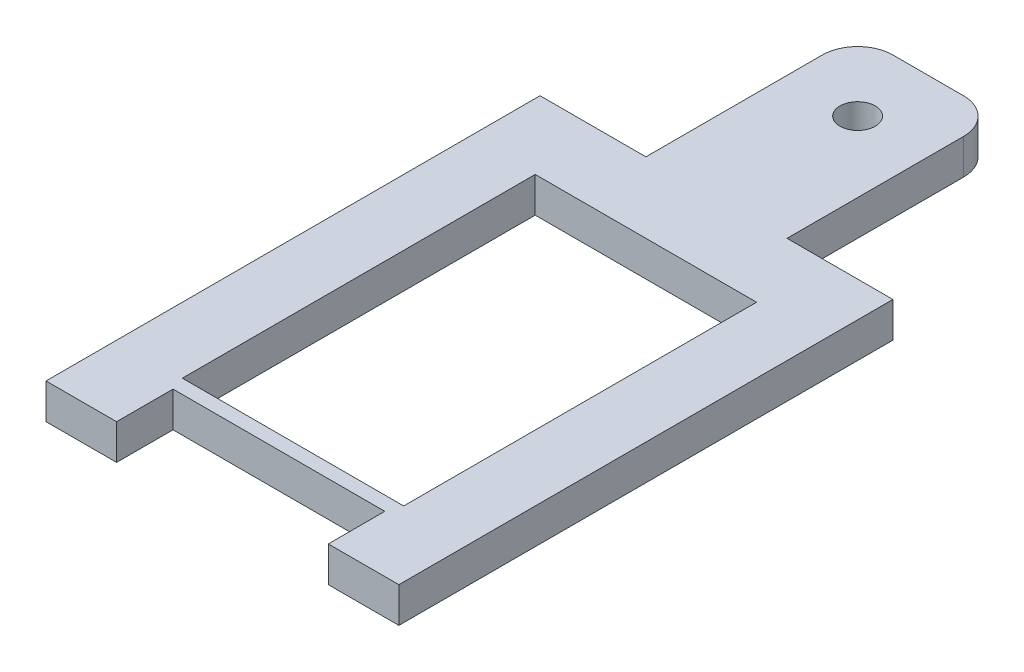
ISO-10303-21;
HEADER;
FILE_DESCRIPTION(('STEP AP214'),'2;1');
FILE_NAME('part.step','',(''),(''),'','','');
FILE_SCHEMA(('AUTOMOTIVE_DESIGN { 1 0 10303 214 1 1 1 1 }'));
ENDSEC;
DATA;
#1=APPLICATION_CONTEXT('core data for automotive mechanical design processes');
#2=APPLICATION_PROTOCOL_DEFINITION('international standard','automotive_design',2000,#1);
#3=PRODUCT_CONTEXT('',#1,'mechanical');
#4=PRODUCT('Part','Part','',(#3));
#5=PRODUCT_RELATED_PRODUCT_CATEGORY('part','',(#4));
#6=PRODUCT_DEFINITION_FORMATION('','',#4);
#7=PRODUCT_DEFINITION_CONTEXT('part definition',#1,'design');
#8=PRODUCT_DEFINITION('design','',#6,#7);
#9=PRODUCT_DEFINITION_SHAPE('','',#8);
#10=(LENGTH_UNIT() NAMED_UNIT(*) SI_UNIT(.MILLI.,.METRE.));
#11=(NAMED_UNIT(*) PLANE_ANGLE_UNIT() SI_UNIT($,.RADIAN.));
#12=(NAMED_UNIT(*) SI_UNIT($,.STERADIAN.) SOLID_ANGLE_UNIT());
#13=UNCERTAINTY_MEASURE_WITH_UNIT(LENGTH_MEASURE(1.E-05),#10,'distance_accuracy_value','');
#14=(GEOMETRIC_REPRESENTATION_CONTEXT(3) GLOBAL_UNCERTAINTY_ASSIGNED_CONTEXT((#13)) GLOBAL_UNIT_ASSIGNED_CONTEXT((#10,
#11,#12)) REPRESENTATION_CONTEXT('',''));
#15=CARTESIAN_POINT('',(0.,0.,0.));
#16=DIRECTION('',(0.,0.,1.));
#17=DIRECTION('',(1.,0.,0.));
#18=AXIS2_PLACEMENT_3D('',#15,#16,#17);
#19=CARTESIAN_POINT('',(1.27,1.27,-15.24));
#20=DIRECTION('',(0.,1.,0.));
#21=DIRECTION('',(0.,0.,1.));
#22=AXIS2_PLACEMENT_3D('',#19,#20,#21);
#23=PLANE('',#22);
#24=DIRECTION('',(1.,0.,0.));
#25=VECTOR('',#24,1.);
#26=CARTESIAN_POINT('',(3.98296055983701,1.27,6.35));
#27=LINE('',#26,#25);
#28=CARTESIAN_POINT('',(-3.98296055983701,1.27,6.35));
#29=VERTEX_POINT('',#28);
#30=CARTESIAN_POINT('',(3.98296055983701,1.27,6.35));
#31=VERTEX_POINT('',#30);
#32=EDGE_CURVE('E167',#29,#31,#27,.T.);
#33=ORIENTED_EDGE('',*,*,#32,.F.);
#34=DIRECTION('',(0.,0.,1.));
#35=VECTOR('',#34,1.);
#36=CARTESIAN_POINT('',(-3.98296055983701,1.27,6.35));
#37=LINE('',#36,#35);
#38=CARTESIAN_POINT('',(-3.98296055983701,1.27,-6.35));
#39=VERTEX_POINT('',#38);
#40=EDGE_CURVE('E159',#39,#29,#37,.T.);
#41=ORIENTED_EDGE('',*,*,#40,.F.);
#42=DIRECTION('',(-1.,0.,0.));
#43=VECTOR('',#42,1.);
#44=CARTESIAN_POINT('',(3.98296055983701,1.27,-6.35));
#45=LINE('',#44,#43);
#46=CARTESIAN_POINT('',(3.98296055983701,1.27,-6.35));
#47=VERTEX_POINT('',#46);
#48=EDGE_CURVE('E182',#47,#39,#45,.T.);
#49=ORIENTED_EDGE('',*,*,#48,.F.);
#50=DIRECTION('',(0.,0.,-1.));
#51=VECTOR('',#50,1.);
#52=CARTESIAN_POINT('',(3.98296055983701,1.27,6.35));
#53=LINE('',#52,#51);
#54=EDGE_CURVE('E180',#31,#47,#53,.T.);
#55=ORIENTED_EDGE('',*,*,#54,.F.);
#56=EDGE_LOOP('',(#33,#41,#49,#55));
#57=FACE_BOUND('',#56,.T.);
#58=DIRECTION('',(-1.,0.,0.));
#59=VECTOR('',#58,1.);
#60=CARTESIAN_POINT('',(-2.54,1.27,-8.89));
#61=LINE('',#60,#59);
#62=CARTESIAN_POINT('',(-2.54,1.27,-8.89));
#63=VERTEX_POINT('',#62);
#64=CARTESIAN_POINT('',(-6.35,1.27,-8.89));
#65=VERTEX_POINT('',#64);
#66=EDGE_CURVE('E198',#63,#65,#61,.T.);
#67=ORIENTED_EDGE('',*,*,#66,.T.);
#68=DIRECTION('',(0.,0.,1.));
#69=VECTOR('',#68,1.);
#70=CARTESIAN_POINT('',(-6.35,1.27,8.89));
#71=LINE('',#70,#69);
#72=CARTESIAN_POINT('',(-6.35,1.27,8.89));
#73=VERTEX_POINT('',#72);
#74=EDGE_CURVE('E201',#65,#73,#71,.T.);
#75=ORIENTED_EDGE('',*,*,#74,.T.);
#76=DIRECTION('',(1.,0.,0.));
#77=VECTOR('',#76,1.);
#78=CARTESIAN_POINT('',(-3.81,1.27,8.89));
#79=LINE('',#78,#77);
#80=CARTESIAN_POINT('',(-3.81,1.27,8.89));
#81=VERTEX_POINT('',#80);
#82=EDGE_CURVE('E204',#73,#81,#79,.T.);
#83=ORIENTED_EDGE('',*,*,#82,.T.);
#84=DIRECTION('',(0.,0.,-1.));
#85=VECTOR('',#84,1.);
#86=CARTESIAN_POINT('',(-3.81,1.27,6.858));
#87=LINE('',#86,#85);
#88=CARTESIAN_POINT('',(-3.81,1.27,6.858));
#89=VERTEX_POINT('',#88);
#90=EDGE_CURVE('E206',#81,#89,#87,.T.);
#91=ORIENTED_EDGE('',*,*,#90,.T.);
#92=DIRECTION('',(1.,0.,0.));
#93=VECTOR('',#92,1.);
#94=CARTESIAN_POINT('',(-3.81,1.27,6.858));
#95=LINE('',#94,#93);
#96=CARTESIAN_POINT('',(3.81,1.27,6.858));
#97=VERTEX_POINT('',#96);
#98=EDGE_CURVE('E208',#89,#97,#95,.T.);
#99=ORIENTED_EDGE('',*,*,#98,.T.);
#100=DIRECTION('',(0.,0.,1.));
#101=VECTOR('',#100,1.);
#102=CARTESIAN_POINT('',(3.81,1.27,6.858));
#103=LINE('',#102,#101);
#104=CARTESIAN_POINT('',(3.81,1.27,8.89));
#105=VERTEX_POINT('',#104);
#106=EDGE_CURVE('E210',#97,#105,#103,.T.);
#107=ORIENTED_EDGE('',*,*,#106,.T.);
#108=DIRECTION('',(1.,0.,0.));
#109=VECTOR('',#108,1.);
#110=CARTESIAN_POINT('',(3.81,1.27,8.89));
#111=LINE('',#110,#109);
#112=CARTESIAN_POINT('',(6.35,1.27,8.89));
#113=VERTEX_POINT('',#112);
#114=EDGE_CURVE('E212',#105,#113,#111,.T.);
#115=ORIENTED_EDGE('',*,*,#114,.T.);
#116=DIRECTION('',(0.,0.,-1.));
#117=VECTOR('',#116,1.);
#118=CARTESIAN_POINT('',(6.35,1.27,8.89));
#119=LINE('',#118,#117);
#120=CARTESIAN_POINT('',(6.35,1.27,-8.89));
#121=VERTEX_POINT('',#120);
#122=EDGE_CURVE('E214',#113,#121,#119,.T.);
#123=ORIENTED_EDGE('',*,*,#122,.T.);
#124=DIRECTION('',(-1.,0.,0.));
#125=VECTOR('',#124,1.);
#126=CARTESIAN_POINT('',(2.54,1.27,-8.89));
#127=LINE('',#126,#125);
#128=CARTESIAN_POINT('',(2.54,1.27,-8.89));
#129=VERTEX_POINT('',#128);
#130=EDGE_CURVE('E216',#121,#129,#127,.T.);
#131=ORIENTED_EDGE('',*,*,#130,.T.);
#132=DIRECTION('',(0.,0.,-1.));
#133=VECTOR('',#132,1.);
#134=CARTESIAN_POINT('',(2.54,1.27,-8.89));
#135=LINE('',#134,#133);
#136=CARTESIAN_POINT('',(2.54,1.27,-15.24));
#137=VERTEX_POINT('',#136);
#138=EDGE_CURVE('E218',#129,#137,#135,.T.);
#139=ORIENTED_EDGE('',*,*,#138,.T.);
#140=CARTESIAN_POINT('',(1.27,1.27,-15.24));
#141=DIRECTION('',(0.,1.,0.));
#142=DIRECTION('',(0.,0.,1.));
#143=AXIS2_PLACEMENT_3D('',#140,#141,#142);
#144=CIRCLE('',#143,1.26999999999999);
#145=CARTESIAN_POINT('',(1.27,1.27,-16.51));
#146=VERTEX_POINT('',#145);
#147=EDGE_CURVE('E220',#137,#146,#144,.T.);
#148=ORIENTED_EDGE('',*,*,#147,.T.);
#149=DIRECTION('',(-1.,0.,0.));
#150=VECTOR('',#149,1.);
#151=CARTESIAN_POINT('',(-1.27,1.27,-16.51));
#152=LINE('',#151,#150);
#153=CARTESIAN_POINT('',(-1.27,1.27,-16.51));
#154=VERTEX_POINT('',#153);
#155=EDGE_CURVE('E222',#146,#154,#152,.T.);
#156=ORIENTED_EDGE('',*,*,#155,.T.);
#157=CARTESIAN_POINT('',(-1.27,1.27,-15.24));
#158=DIRECTION('',(0.,1.,0.));
#159=DIRECTION('',(0.,0.,-1.));
#160=AXIS2_PLACEMENT_3D('',#157,#158,#159);
#161=CIRCLE('',#160,1.26999999999999);
#162=CARTESIAN_POINT('',(-2.54,1.27,-15.24));
#163=VERTEX_POINT('',#162);
#164=EDGE_CURVE('E224',#154,#163,#161,.T.);
#165=ORIENTED_EDGE('',*,*,#164,.T.);
#166=DIRECTION('',(0.,0.,1.));
#167=VECTOR('',#166,1.);
#168=CARTESIAN_POINT('',(-2.54,1.27,-8.89));
#169=LINE('',#168,#167);
#170=EDGE_CURVE('E226',#163,#63,#169,.T.);
#171=ORIENTED_EDGE('',*,*,#170,.T.);
#172=EDGE_LOOP('',(#67,#75,#83,#91,#99,#107,#115,#123,#131,#139,#148,#156,#165,#171));
#173=FACE_BOUND('',#172,.T.);
#174=CARTESIAN_POINT('',(0.,1.27,-13.97));
#175=DIRECTION('',(0.,1.,0.));
#176=DIRECTION('',(0.,0.,1.));
#177=AXIS2_PLACEMENT_3D('',#174,#175,#176);
#178=CIRCLE('',#177,0.635);
#179=CARTESIAN_POINT('',(0.,1.27,-13.335));
#180=VERTEX_POINT('',#179);
#181=EDGE_CURVE('E188',#180,#180,#178,.T.);
#182=ORIENTED_EDGE('',*,*,#181,.F.);
#183=EDGE_LOOP('',(#182));
#184=FACE_BOUND('',#183,.T.);
#185=ADVANCED_FACE('F34',(#57,#173,#184),#23,.T.);
#186=CARTESIAN_POINT('',(1.27,0.,-15.24));
#187=DIRECTION('',(0.,1.,0.));
#188=DIRECTION('',(0.,0.,1.));
#189=AXIS2_PLACEMENT_3D('',#186,#187,#188);
#190=PLANE('',#189);
#191=DIRECTION('',(-1.,0.,0.));
#192=VECTOR('',#191,1.);
#193=CARTESIAN_POINT('',(-2.54,0.,-8.89));
#194=LINE('',#193,#192);
#195=CARTESIAN_POINT('',(-2.54,0.,-8.89));
#196=VERTEX_POINT('',#195);
#197=CARTESIAN_POINT('',(-6.35,0.,-8.89));
#198=VERTEX_POINT('',#197);
#199=EDGE_CURVE('E175',#196,#198,#194,.T.);
#200=ORIENTED_EDGE('',*,*,#199,.F.);
#201=DIRECTION('',(0.,0.,1.));
#202=VECTOR('',#201,1.);
#203=CARTESIAN_POINT('',(-2.54,0.,-8.89));
#204=LINE('',#203,#202);
#205=CARTESIAN_POINT('',(-2.54,0.,-15.24));
#206=VERTEX_POINT('',#205);
#207=EDGE_CURVE('E202',#206,#196,#204,.T.);
#208=ORIENTED_EDGE('',*,*,#207,.F.);
#209=CARTESIAN_POINT('',(-1.27,0.,-15.24));
#210=DIRECTION('',(0.,1.,0.));
#211=DIRECTION('',(0.,0.,-1.));
#212=AXIS2_PLACEMENT_3D('',#209,#210,#211);
#213=CIRCLE('',#212,1.26999999999999);
#214=CARTESIAN_POINT('',(-1.27,0.,-16.51));
#215=VERTEX_POINT('',#214);
#216=EDGE_CURVE('E253',#215,#206,#213,.T.);
#217=ORIENTED_EDGE('',*,*,#216,.F.);
#218=DIRECTION('',(-1.,0.,0.));
#219=VECTOR('',#218,1.);
#220=CARTESIAN_POINT('',(-1.27,0.,-16.51));
#221=LINE('',#220,#219);
#222=CARTESIAN_POINT('',(1.27,0.,-16.51));
#223=VERTEX_POINT('',#222);
#224=EDGE_CURVE('E251',#223,#215,#221,.T.);
#225=ORIENTED_EDGE('',*,*,#224,.F.);
#226=CARTESIAN_POINT('',(1.27,0.,-15.24));
#227=DIRECTION('',(0.,1.,0.));
#228=DIRECTION('',(0.,0.,1.));
#229=AXIS2_PLACEMENT_3D('',#226,#227,#228);
#230=CIRCLE('',#229,1.26999999999999);
#231=CARTESIAN_POINT('',(2.54,0.,-15.24));
#232=VERTEX_POINT('',#231);
#233=EDGE_CURVE('E249',#232,#223,#230,.T.);
#234=ORIENTED_EDGE('',*,*,#233,.F.);
#235=DIRECTION('',(0.,0.,-1.));
#236=VECTOR('',#235,1.);
#237=CARTESIAN_POINT('',(2.54,0.,-8.89));
#238=LINE('',#237,#236);
#239=CARTESIAN_POINT('',(2.54,0.,-8.89));
#240=VERTEX_POINT('',#239);
#241=EDGE_CURVE('E247',#240,#232,#238,.T.);
#242=ORIENTED_EDGE('',*,*,#241,.F.);
#243=DIRECTION('',(-1.,0.,0.));
#244=VECTOR('',#243,1.);
#245=CARTESIAN_POINT('',(2.54,0.,-8.89));
#246=LINE('',#245,#244);
#247=CARTESIAN_POINT('',(6.35,0.,-8.89));
#248=VERTEX_POINT('',#247);
#249=EDGE_CURVE('E245',#248,#240,#246,.T.);
#250=ORIENTED_EDGE('',*,*,#249,.F.);
#251=DIRECTION('',(0.,0.,-1.));
#252=VECTOR('',#251,1.);
#253=CARTESIAN_POINT('',(6.35,0.,8.89));
#254=LINE('',#253,#252);
#255=CARTESIAN_POINT('',(6.35,0.,8.89));
#256=VERTEX_POINT('',#255);
#257=EDGE_CURVE('E243',#256,#248,#254,.T.);
#258=ORIENTED_EDGE('',*,*,#257,.F.);
#259=DIRECTION('',(1.,0.,0.));
#260=VECTOR('',#259,1.);
#261=CARTESIAN_POINT('',(3.81,0.,8.89));
#262=LINE('',#261,#260);
#263=CARTESIAN_POINT('',(3.81,0.,8.89));
#264=VERTEX_POINT('',#263);
#265=EDGE_CURVE('E241',#264,#256,#262,.T.);
#266=ORIENTED_EDGE('',*,*,#265,.F.);
#267=DIRECTION('',(0.,0.,1.));
#268=VECTOR('',#267,1.);
#269=CARTESIAN_POINT('',(3.81,0.,6.858));
#270=LINE('',#269,#268);
#271=CARTESIAN_POINT('',(3.81,0.,6.858));
#272=VERTEX_POINT('',#271);
#273=EDGE_CURVE('E239',#272,#264,#270,.T.);
#274=ORIENTED_EDGE('',*,*,#273,.F.);
#275=DIRECTION('',(1.,0.,0.));
#276=VECTOR('',#275,1.);
#277=CARTESIAN_POINT('',(-3.81,0.,6.858));
#278=LINE('',#277,#276);
#279=CARTESIAN_POINT('',(-3.81,0.,6.858));
#280=VERTEX_POINT('',#279);
#281=EDGE_CURVE('E237',#280,#272,#278,.T.);
#282=ORIENTED_EDGE('',*,*,#281,.F.);
#283=DIRECTION('',(0.,0.,-1.));
#284=VECTOR('',#283,1.);
#285=CARTESIAN_POINT('',(-3.81,0.,6.858));
#286=LINE('',#285,#284);
#287=CARTESIAN_POINT('',(-3.81,0.,8.89));
#288=VERTEX_POINT('',#287);
#289=EDGE_CURVE('E235',#288,#280,#286,.T.);
#290=ORIENTED_EDGE('',*,*,#289,.F.);
#291=DIRECTION('',(1.,0.,0.));
#292=VECTOR('',#291,1.);
#293=CARTESIAN_POINT('',(-3.81,0.,8.89));
#294=LINE('',#293,#292);
#295=CARTESIAN_POINT('',(-6.35,0.,8.89));
#296=VERTEX_POINT('',#295);
#297=EDGE_CURVE('E233',#296,#288,#294,.T.);
#298=ORIENTED_EDGE('',*,*,#297,.F.);
#299=DIRECTION('',(0.,0.,1.));
#300=VECTOR('',#299,1.);
#301=CARTESIAN_POINT('',(-6.35,0.,8.89));
#302=LINE('',#301,#300);
#303=EDGE_CURVE('E231',#198,#296,#302,.T.);
#304=ORIENTED_EDGE('',*,*,#303,.F.);
#305=EDGE_LOOP('',(#200,#208,#217,#225,#234,#242,#250,#258,#266,#274,#282,#290,#298,#304));
#306=FACE_BOUND('',#305,.T.);
#307=DIRECTION('',(0.,0.,1.));
#308=VECTOR('',#307,1.);
#309=CARTESIAN_POINT('',(-3.98296055983701,0.,6.35));
#310=LINE('',#309,#308);
#311=CARTESIAN_POINT('',(-3.98296055983701,0.,-6.35));
#312=VERTEX_POINT('',#311);
#313=CARTESIAN_POINT('',(-3.98296055983701,0.,6.35));
#314=VERTEX_POINT('',#313);
#315=EDGE_CURVE('E57',#312,#314,#310,.T.);
#316=ORIENTED_EDGE('',*,*,#315,.T.);
#317=DIRECTION('',(1.,0.,0.));
#318=VECTOR('',#317,1.);
#319=CARTESIAN_POINT('',(3.98296055983701,0.,6.35));
#320=LINE('',#319,#318);
#321=CARTESIAN_POINT('',(3.98296055983701,0.,6.35));
#322=VERTEX_POINT('',#321);
#323=EDGE_CURVE('E174',#314,#322,#320,.T.);
#324=ORIENTED_EDGE('',*,*,#323,.T.);
#325=DIRECTION('',(0.,0.,-1.));
#326=VECTOR('',#325,1.);
#327=CARTESIAN_POINT('',(3.98296055983701,0.,6.35));
#328=LINE('',#327,#326);
#329=CARTESIAN_POINT('',(3.98296055983701,0.,-6.35));
#330=VERTEX_POINT('',#329);
#331=EDGE_CURVE('E190',#322,#330,#328,.T.);
#332=ORIENTED_EDGE('',*,*,#331,.T.);
#333=DIRECTION('',(-1.,0.,0.));
#334=VECTOR('',#333,1.);
#335=CARTESIAN_POINT('',(3.98296055983701,0.,-6.35));
#336=LINE('',#335,#334);
#337=EDGE_CURVE('E168',#330,#312,#336,.T.);
#338=ORIENTED_EDGE('',*,*,#337,.T.);
#339=EDGE_LOOP('',(#316,#324,#332,#338));
#340=FACE_BOUND('',#339,.T.);
#341=CARTESIAN_POINT('',(0.,0.,-13.97));
#342=DIRECTION('',(0.,1.,0.));
#343=DIRECTION('',(0.,0.,1.));
#344=AXIS2_PLACEMENT_3D('',#341,#342,#343);
#345=CIRCLE('',#344,0.635);
#346=CARTESIAN_POINT('',(0.,0.,-13.335));
#347=VERTEX_POINT('',#346);
#348=EDGE_CURVE('E538',#347,#347,#345,.T.);
#349=ORIENTED_EDGE('',*,*,#348,.T.);
#350=EDGE_LOOP('',(#349));
#351=FACE_BOUND('',#350,.T.);
#352=ADVANCED_FACE('F301',(#306,#340,#351),#190,.F.);
#353=CARTESIAN_POINT('',(-2.54,1.27,-8.89));
#354=DIRECTION('',(0.,0.,1.));
#355=DIRECTION('',(1.,0.,0.));
#356=AXIS2_PLACEMENT_3D('',#353,#354,#355);
#357=PLANE('',#356);
#358=ORIENTED_EDGE('',*,*,#199,.T.);
#359=DIRECTION('',(0.,-1.,0.));
#360=VECTOR('',#359,1.);
#361=CARTESIAN_POINT('',(-6.35,1.27,-8.89));
#362=LINE('',#361,#360);
#363=EDGE_CURVE('E11',#65,#198,#362,.T.);
#364=ORIENTED_EDGE('',*,*,#363,.F.);
#365=ORIENTED_EDGE('',*,*,#66,.F.);
#366=DIRECTION('',(0.,-1.,0.));
#367=VECTOR('',#366,1.);
#368=CARTESIAN_POINT('',(-2.54,1.27,-8.89));
#369=LINE('',#368,#367);
#370=EDGE_CURVE('E228',#63,#196,#369,.T.);
#371=ORIENTED_EDGE('',*,*,#370,.T.);
#372=EDGE_LOOP('',(#358,#364,#365,#371));
#373=FACE_BOUND('',#372,.T.);
#374=ADVANCED_FACE('F36',(#373),#357,.F.);
#375=CARTESIAN_POINT('',(-6.35,1.27,8.89));
#376=DIRECTION('',(1.,0.,0.));
#377=DIRECTION('',(0.,0.,-1.));
#378=AXIS2_PLACEMENT_3D('',#375,#376,#377);
#379=PLANE('',#378);
#380=ORIENTED_EDGE('',*,*,#303,.T.);
#381=DIRECTION('',(0.,-1.,0.));
#382=VECTOR('',#381,1.);
#383=CARTESIAN_POINT('',(-6.35,1.27,8.89));
#384=LINE('',#383,#382);
#385=EDGE_CURVE('E42',#73,#296,#384,.T.);
#386=ORIENTED_EDGE('',*,*,#385,.F.);
#387=ORIENTED_EDGE('',*,*,#74,.F.);
#388=ORIENTED_EDGE('',*,*,#363,.T.);
#389=EDGE_LOOP('',(#380,#386,#387,#388));
#390=FACE_BOUND('',#389,.T.);
#391=ADVANCED_FACE('F318',(#390),#379,.F.);
#392=CARTESIAN_POINT('',(-3.81,1.27,8.89));
#393=DIRECTION('',(0.,0.,-1.));
#394=DIRECTION('',(-1.,0.,0.));
#395=AXIS2_PLACEMENT_3D('',#392,#393,#394);
#396=PLANE('',#395);
#397=ORIENTED_EDGE('',*,*,#297,.T.);
#398=DIRECTION('',(0.,-1.,0.));
#399=VECTOR('',#398,1.);
#400=CARTESIAN_POINT('',(-3.81,1.27,8.89));
#401=LINE('',#400,#399);
#402=EDGE_CURVE('E288',#81,#288,#401,.T.);
#403=ORIENTED_EDGE('',*,*,#402,.F.);
#404=ORIENTED_EDGE('',*,*,#82,.F.);
#405=ORIENTED_EDGE('',*,*,#385,.T.);
#406=EDGE_LOOP('',(#397,#403,#404,#405));
#407=FACE_BOUND('',#406,.T.);
#408=ADVANCED_FACE('F295',(#407),#396,.F.);
#409=CARTESIAN_POINT('',(-3.81,1.27,6.858));
#410=DIRECTION('',(-1.,0.,0.));
#411=DIRECTION('',(0.,0.,1.));
#412=AXIS2_PLACEMENT_3D('',#409,#410,#411);
#413=PLANE('',#412);
#414=ORIENTED_EDGE('',*,*,#289,.T.);
#415=DIRECTION('',(0.,-1.,0.));
#416=VECTOR('',#415,1.);
#417=CARTESIAN_POINT('',(-3.81,1.27,6.858));
#418=LINE('',#417,#416);
#419=EDGE_CURVE('E285',#89,#280,#418,.T.);
#420=ORIENTED_EDGE('',*,*,#419,.F.);
#421=ORIENTED_EDGE('',*,*,#90,.F.);
#422=ORIENTED_EDGE('',*,*,#402,.T.);
#423=EDGE_LOOP('',(#414,#420,#421,#422));
#424=FACE_BOUND('',#423,.T.);
#425=ADVANCED_FACE('F307',(#424),#413,.F.);
#426=CARTESIAN_POINT('',(-3.81,1.27,6.858));
#427=DIRECTION('',(0.,0.,-1.));
#428=DIRECTION('',(-1.,0.,0.));
#429=AXIS2_PLACEMENT_3D('',#426,#427,#428);
#430=PLANE('',#429);
#431=ORIENTED_EDGE('',*,*,#281,.T.);
#432=DIRECTION('',(0.,-1.,0.));
#433=VECTOR('',#432,1.);
#434=CARTESIAN_POINT('',(3.81,1.27,6.858));
#435=LINE('',#434,#433);
#436=EDGE_CURVE('E282',#97,#272,#435,.T.);
#437=ORIENTED_EDGE('',*,*,#436,.F.);
#438=ORIENTED_EDGE('',*,*,#98,.F.);
#439=ORIENTED_EDGE('',*,*,#419,.T.);
#440=EDGE_LOOP('',(#431,#437,#438,#439));
#441=FACE_BOUND('',#440,.T.);
#442=ADVANCED_FACE('F311',(#441),#430,.F.);
#443=CARTESIAN_POINT('',(3.81,1.27,6.858));
#444=DIRECTION('',(1.,0.,0.));
#445=DIRECTION('',(0.,0.,-1.));
#446=AXIS2_PLACEMENT_3D('',#443,#444,#445);
#447=PLANE('',#446);
#448=ORIENTED_EDGE('',*,*,#273,.T.);
#449=DIRECTION('',(0.,-1.,0.));
#450=VECTOR('',#449,1.);
#451=CARTESIAN_POINT('',(3.81,1.27,8.89));
#452=LINE('',#451,#450);
#453=EDGE_CURVE('E279',#105,#264,#452,.T.);
#454=ORIENTED_EDGE('',*,*,#453,.F.);
#455=ORIENTED_EDGE('',*,*,#106,.F.);
#456=ORIENTED_EDGE('',*,*,#436,.T.);
#457=EDGE_LOOP('',(#448,#454,#455,#456));
#458=FACE_BOUND('',#457,.T.);
#459=ADVANCED_FACE('F361',(#458),#447,.F.);
#460=CARTESIAN_POINT('',(3.81,1.27,8.89));
#461=DIRECTION('',(0.,0.,-1.));
#462=DIRECTION('',(-1.,0.,0.));
#463=AXIS2_PLACEMENT_3D('',#460,#461,#462);
#464=PLANE('',#463);
#465=ORIENTED_EDGE('',*,*,#265,.T.);
#466=DIRECTION('',(0.,-1.,0.));
#467=VECTOR('',#466,1.);
#468=CARTESIAN_POINT('',(6.35,1.27,8.89));
#469=LINE('',#468,#467);
#470=EDGE_CURVE('E276',#113,#256,#469,.T.);
#471=ORIENTED_EDGE('',*,*,#470,.F.);
#472=ORIENTED_EDGE('',*,*,#114,.F.);
#473=ORIENTED_EDGE('',*,*,#453,.T.);
#474=EDGE_LOOP('',(#465,#471,#472,#473));
#475=FACE_BOUND('',#474,.T.);
#476=ADVANCED_FACE('F359',(#475),#464,.F.);
#477=CARTESIAN_POINT('',(6.35,1.27,8.89));
#478=DIRECTION('',(-1.,0.,0.));
#479=DIRECTION('',(0.,0.,1.));
#480=AXIS2_PLACEMENT_3D('',#477,#478,#479);
#481=PLANE('',#480);
#482=ORIENTED_EDGE('',*,*,#257,.T.);
#483=DIRECTION('',(0.,-1.,0.));
#484=VECTOR('',#483,1.);
#485=CARTESIAN_POINT('',(6.35,1.27,-8.89));
#486=LINE('',#485,#484);
#487=EDGE_CURVE('E273',#121,#248,#486,.T.);
#488=ORIENTED_EDGE('',*,*,#487,.F.);
#489=ORIENTED_EDGE('',*,*,#122,.F.);
#490=ORIENTED_EDGE('',*,*,#470,.T.);
#491=EDGE_LOOP('',(#482,#488,#489,#490));
#492=FACE_BOUND('',#491,.T.);
#493=ADVANCED_FACE('F354',(#492),#481,.F.);
#494=CARTESIAN_POINT('',(2.54,1.27,-8.89));
#495=DIRECTION('',(0.,0.,1.));
#496=DIRECTION('',(1.,0.,0.));
#497=AXIS2_PLACEMENT_3D('',#494,#495,#496);
#498=PLANE('',#497);
#499=ORIENTED_EDGE('',*,*,#249,.T.);
#500=DIRECTION('',(0.,-1.,0.));
#501=VECTOR('',#500,1.);
#502=CARTESIAN_POINT('',(2.54,1.27,-8.89));
#503=LINE('',#502,#501);
#504=EDGE_CURVE('E270',#129,#240,#503,.T.);
#505=ORIENTED_EDGE('',*,*,#504,.F.);
#506=ORIENTED_EDGE('',*,*,#130,.F.);
#507=ORIENTED_EDGE('',*,*,#487,.T.);
#508=EDGE_LOOP('',(#499,#505,#506,#507));
#509=FACE_BOUND('',#508,.T.);
#510=ADVANCED_FACE('F349',(#509),#498,.F.);
#511=CARTESIAN_POINT('',(2.54,1.27,-8.89));
#512=DIRECTION('',(-1.,0.,0.));
#513=DIRECTION('',(0.,0.,1.));
#514=AXIS2_PLACEMENT_3D('',#511,#512,#513);
#515=PLANE('',#514);
#516=ORIENTED_EDGE('',*,*,#241,.T.);
#517=DIRECTION('',(0.,-1.,0.));
#518=VECTOR('',#517,1.);
#519=CARTESIAN_POINT('',(2.54,1.27,-15.24));
#520=LINE('',#519,#518);
#521=EDGE_CURVE('E267',#137,#232,#520,.T.);
#522=ORIENTED_EDGE('',*,*,#521,.F.);
#523=ORIENTED_EDGE('',*,*,#138,.F.);
#524=ORIENTED_EDGE('',*,*,#504,.T.);
#525=EDGE_LOOP('',(#516,#522,#523,#524));
#526=FACE_BOUND('',#525,.T.);
#527=ADVANCED_FACE('F345',(#526),#515,.F.);
#528=CARTESIAN_POINT('',(1.27,1.27,-15.24));
#529=DIRECTION('',(0.,-1.,0.));
#530=DIRECTION('',(0.,0.,-1.));
#531=AXIS2_PLACEMENT_3D('',#528,#529,#530);
#532=CYLINDRICAL_SURFACE('',#531,1.26999999999999);
#533=ORIENTED_EDGE('',*,*,#233,.T.);
#534=DIRECTION('',(0.,-1.,0.));
#535=VECTOR('',#534,1.);
#536=CARTESIAN_POINT('',(1.27,1.27,-16.51));
#537=LINE('',#536,#535);
#538=EDGE_CURVE('E264',#146,#223,#537,.T.);
#539=ORIENTED_EDGE('',*,*,#538,.F.);
#540=ORIENTED_EDGE('',*,*,#147,.F.);
#541=ORIENTED_EDGE('',*,*,#521,.T.);
#542=EDGE_LOOP('',(#533,#539,#540,#541));
#543=FACE_BOUND('',#542,.T.);
#544=ADVANCED_FACE('F340',(#543),#532,.T.);
#545=CARTESIAN_POINT('',(-1.27,1.27,-16.51));
#546=DIRECTION('',(0.,0.,1.));
#547=DIRECTION('',(1.,0.,0.));
#548=AXIS2_PLACEMENT_3D('',#545,#546,#547);
#549=PLANE('',#548);
#550=ORIENTED_EDGE('',*,*,#224,.T.);
#551=DIRECTION('',(0.,-1.,0.));
#552=VECTOR('',#551,1.);
#553=CARTESIAN_POINT('',(-1.27,1.27,-16.51));
#554=LINE('',#553,#552);
#555=EDGE_CURVE('E261',#154,#215,#554,.T.);
#556=ORIENTED_EDGE('',*,*,#555,.F.);
#557=ORIENTED_EDGE('',*,*,#155,.F.);
#558=ORIENTED_EDGE('',*,*,#538,.T.);
#559=EDGE_LOOP('',(#550,#556,#557,#558));
#560=FACE_BOUND('',#559,.T.);
#561=ADVANCED_FACE('F334',(#560),#549,.F.);
#562=CARTESIAN_POINT('',(-1.27,1.27,-15.24));
#563=DIRECTION('',(0.,-1.,0.));
#564=DIRECTION('',(0.,0.,-1.));
#565=AXIS2_PLACEMENT_3D('',#562,#563,#564);
#566=CYLINDRICAL_SURFACE('',#565,1.26999999999999);
#567=ORIENTED_EDGE('',*,*,#216,.T.);
#568=DIRECTION('',(0.,-1.,0.));
#569=VECTOR('',#568,1.);
#570=CARTESIAN_POINT('',(-2.54,1.27,-15.24));
#571=LINE('',#570,#569);
#572=EDGE_CURVE('E258',#163,#206,#571,.T.);
#573=ORIENTED_EDGE('',*,*,#572,.F.);
#574=ORIENTED_EDGE('',*,*,#164,.F.);
#575=ORIENTED_EDGE('',*,*,#555,.T.);
#576=EDGE_LOOP('',(#567,#573,#574,#575));
#577=FACE_BOUND('',#576,.T.);
#578=ADVANCED_FACE('F330',(#577),#566,.T.);
#579=CARTESIAN_POINT('',(-2.54,1.27,-8.89));
#580=DIRECTION('',(1.,0.,0.));
#581=DIRECTION('',(0.,0.,-1.));
#582=AXIS2_PLACEMENT_3D('',#579,#580,#581);
#583=PLANE('',#582);
#584=ORIENTED_EDGE('',*,*,#207,.T.);
#585=ORIENTED_EDGE('',*,*,#370,.F.);
#586=ORIENTED_EDGE('',*,*,#170,.F.);
#587=ORIENTED_EDGE('',*,*,#572,.T.);
#588=EDGE_LOOP('',(#584,#585,#586,#587));
#589=FACE_BOUND('',#588,.T.);
#590=ADVANCED_FACE('F325',(#589),#583,.F.);
#591=CARTESIAN_POINT('',(-3.98296055983701,1.27,6.35));
#592=DIRECTION('',(1.,0.,0.));
#593=DIRECTION('',(0.,0.,-1.));
#594=AXIS2_PLACEMENT_3D('',#591,#592,#593);
#595=PLANE('',#594);
#596=ORIENTED_EDGE('',*,*,#315,.F.);
#597=DIRECTION('',(0.,-1.,0.));
#598=VECTOR('',#597,1.);
#599=CARTESIAN_POINT('',(-3.98296055983701,1.27,-6.35));
#600=LINE('',#599,#598);
#601=EDGE_CURVE('E163',#39,#312,#600,.T.);
#602=ORIENTED_EDGE('',*,*,#601,.F.);
#603=ORIENTED_EDGE('',*,*,#40,.T.);
#604=DIRECTION('',(0.,-1.,0.));
#605=VECTOR('',#604,1.);
#606=CARTESIAN_POINT('',(-3.98296055983701,1.27,6.35));
#607=LINE('',#606,#605);
#608=EDGE_CURVE('E162',#29,#314,#607,.T.);
#609=ORIENTED_EDGE('',*,*,#608,.T.);
#610=EDGE_LOOP('',(#596,#602,#603,#609));
#611=FACE_BOUND('',#610,.T.);
#612=ADVANCED_FACE('F161',(#611),#595,.T.);
#613=CARTESIAN_POINT('',(3.98296055983701,1.27,6.35));
#614=DIRECTION('',(0.,0.,-1.));
#615=DIRECTION('',(-1.,0.,0.));
#616=AXIS2_PLACEMENT_3D('',#613,#614,#615);
#617=PLANE('',#616);
#618=ORIENTED_EDGE('',*,*,#323,.F.);
#619=ORIENTED_EDGE('',*,*,#608,.F.);
#620=ORIENTED_EDGE('',*,*,#32,.T.);
#621=DIRECTION('',(0.,-1.,0.));
#622=VECTOR('',#621,1.);
#623=CARTESIAN_POINT('',(3.98296055983701,1.27,6.35));
#624=LINE('',#623,#622);
#625=EDGE_CURVE('E176',#31,#322,#624,.T.);
#626=ORIENTED_EDGE('',*,*,#625,.T.);
#627=EDGE_LOOP('',(#618,#619,#620,#626));
#628=FACE_BOUND('',#627,.T.);
#629=ADVANCED_FACE('F171',(#628),#617,.T.);
#630=CARTESIAN_POINT('',(3.98296055983701,1.27,6.35));
#631=DIRECTION('',(-1.,0.,0.));
#632=DIRECTION('',(0.,0.,1.));
#633=AXIS2_PLACEMENT_3D('',#630,#631,#632);
#634=PLANE('',#633);
#635=ORIENTED_EDGE('',*,*,#331,.F.);
#636=ORIENTED_EDGE('',*,*,#625,.F.);
#637=ORIENTED_EDGE('',*,*,#54,.T.);
#638=DIRECTION('',(0.,-1.,0.));
#639=VECTOR('',#638,1.);
#640=CARTESIAN_POINT('',(3.98296055983701,1.27,-6.35));
#641=LINE('',#640,#639);
#642=EDGE_CURVE('E49',#47,#330,#641,.T.);
#643=ORIENTED_EDGE('',*,*,#642,.T.);
#644=EDGE_LOOP('',(#635,#636,#637,#643));
#645=FACE_BOUND('',#644,.T.);
#646=ADVANCED_FACE('F431',(#645),#634,.T.);
#647=CARTESIAN_POINT('',(3.98296055983701,1.27,-6.35));
#648=DIRECTION('',(0.,0.,1.));
#649=DIRECTION('',(1.,0.,0.));
#650=AXIS2_PLACEMENT_3D('',#647,#648,#649);
#651=PLANE('',#650);
#652=ORIENTED_EDGE('',*,*,#337,.F.);
#653=ORIENTED_EDGE('',*,*,#642,.F.);
#654=ORIENTED_EDGE('',*,*,#48,.T.);
#655=ORIENTED_EDGE('',*,*,#601,.T.);
#656=EDGE_LOOP('',(#652,#653,#654,#655));
#657=FACE_BOUND('',#656,.T.);
#658=ADVANCED_FACE('F437',(#657),#651,.T.);
#659=CARTESIAN_POINT('',(0.,1.27,-13.97));
#660=DIRECTION('',(0.,-1.,0.));
#661=DIRECTION('',(0.,0.,-1.));
#662=AXIS2_PLACEMENT_3D('',#659,#660,#661);
#663=CYLINDRICAL_SURFACE('',#662,0.635);
#664=ORIENTED_EDGE('',*,*,#181,.T.);
#665=EDGE_LOOP('',(#664));
#666=FACE_BOUND('',#665,.T.);
#667=ORIENTED_EDGE('',*,*,#348,.F.);
#668=EDGE_LOOP('',(#667));
#669=FACE_BOUND('',#668,.T.);
#670=ADVANCED_FACE('F445',(#666,#669),#663,.F.);
#671=CLOSED_SHELL('',(#185,#352,#374,#391,#408,#425,#442,#459,#476,#493,#510,#527,#544,#561,
#578,#590,#612,#629,#646,#658,#670));
#672=MANIFOLD_SOLID_BREP('B2',#671);
#673=ADVANCED_BREP_SHAPE_REPRESENTATION('',(#18,#672),#14);
#674=SHAPE_DEFINITION_REPRESENTATION(#9,#673);
ENDSEC;
END-ISO-10303-21;
